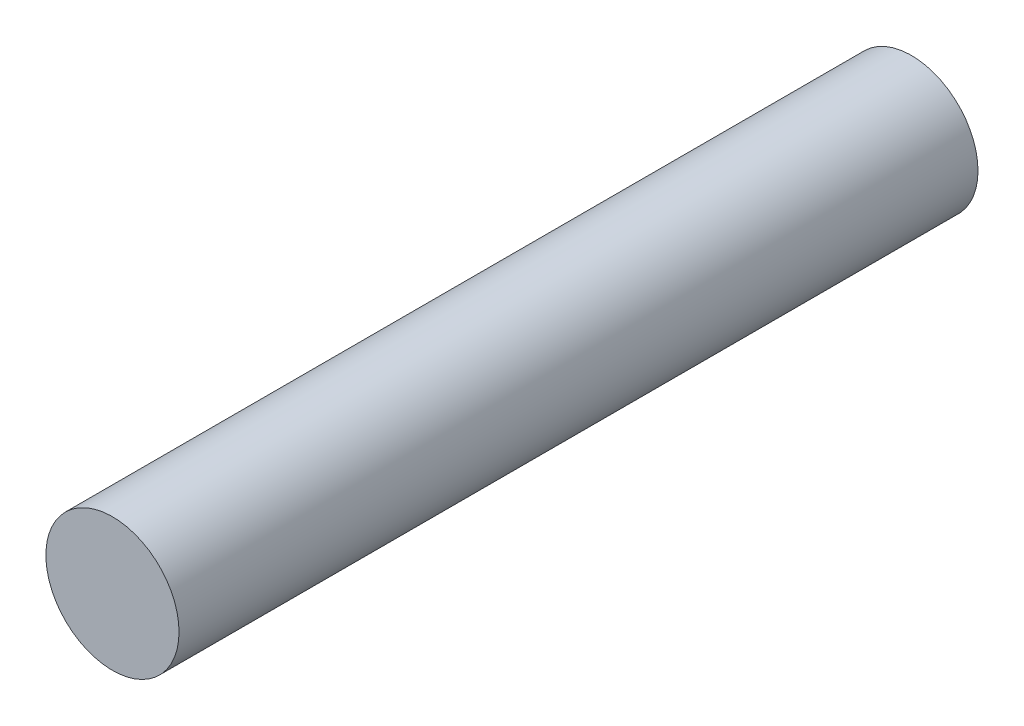
ISO-10303-21;
HEADER;
FILE_DESCRIPTION(('STEP AP214'),'2;1');
FILE_NAME('part.step','',(''),(''),'','','');
FILE_SCHEMA(('AUTOMOTIVE_DESIGN { 1 0 10303 214 1 1 1 1 }'));
ENDSEC;
DATA;
#1=APPLICATION_CONTEXT('core data for automotive mechanical design processes');
#2=APPLICATION_PROTOCOL_DEFINITION('international standard','automotive_design',2000,#1);
#3=PRODUCT_CONTEXT('',#1,'mechanical');
#4=PRODUCT('Part','Part','',(#3));
#5=PRODUCT_RELATED_PRODUCT_CATEGORY('part','',(#4));
#6=PRODUCT_DEFINITION_FORMATION('','',#4);
#7=PRODUCT_DEFINITION_CONTEXT('part definition',#1,'design');
#8=PRODUCT_DEFINITION('design','',#6,#7);
#9=PRODUCT_DEFINITION_SHAPE('','',#8);
#10=(LENGTH_UNIT() NAMED_UNIT(*) SI_UNIT(.MILLI.,.METRE.));
#11=(NAMED_UNIT(*) PLANE_ANGLE_UNIT() SI_UNIT($,.RADIAN.));
#12=(NAMED_UNIT(*) SI_UNIT($,.STERADIAN.) SOLID_ANGLE_UNIT());
#13=UNCERTAINTY_MEASURE_WITH_UNIT(LENGTH_MEASURE(1.E-05),#10,'distance_accuracy_value','');
#14=(GEOMETRIC_REPRESENTATION_CONTEXT(3) GLOBAL_UNCERTAINTY_ASSIGNED_CONTEXT((#13)) GLOBAL_UNIT_ASSIGNED_CONTEXT((#10,
#11,#12)) REPRESENTATION_CONTEXT('',''));
#15=CARTESIAN_POINT('',(0.,0.,0.));
#16=DIRECTION('',(0.,0.,1.));
#17=DIRECTION('',(1.,0.,0.));
#18=AXIS2_PLACEMENT_3D('',#15,#16,#17);
#19=CARTESIAN_POINT('',(-5.9147238073035,4.89993598442764,76.2));
#20=DIRECTION('',(0.,0.,-1.));
#21=DIRECTION('',(-1.,0.,0.));
#22=AXIS2_PLACEMENT_3D('',#19,#20,#21);
#23=CYLINDRICAL_SURFACE('',#22,6.35);
#24=CARTESIAN_POINT('',(-5.9147238073035,4.89993598442764,76.2));
#25=DIRECTION('',(0.,0.,1.));
#26=DIRECTION('',(1.,0.,0.));
#27=AXIS2_PLACEMENT_3D('',#24,#25,#26);
#28=CIRCLE('',#27,6.35);
#29=CARTESIAN_POINT('',(0.435276192696504,4.89993598442764,76.2));
#30=VERTEX_POINT('',#29);
#31=EDGE_CURVE('E10',#30,#30,#28,.T.);
#32=ORIENTED_EDGE('',*,*,#31,.F.);
#33=EDGE_LOOP('',(#32));
#34=FACE_BOUND('',#33,.T.);
#35=CARTESIAN_POINT('',(-5.9147238073035,4.89993598442764,0.));
#36=DIRECTION('',(0.,0.,1.));
#37=DIRECTION('',(1.,0.,0.));
#38=AXIS2_PLACEMENT_3D('',#35,#36,#37);
#39=CIRCLE('',#38,6.35);
#40=CARTESIAN_POINT('',(0.435276192696504,4.89993598442764,0.));
#41=VERTEX_POINT('',#40);
#42=EDGE_CURVE('E39',#41,#41,#39,.T.);
#43=ORIENTED_EDGE('',*,*,#42,.T.);
#44=EDGE_LOOP('',(#43));
#45=FACE_BOUND('',#44,.T.);
#46=ADVANCED_FACE('F36',(#34,#45),#23,.T.);
#47=CARTESIAN_POINT('',(-5.9147238073035,4.89993598442764,76.2));
#48=DIRECTION('',(0.,0.,1.));
#49=DIRECTION('',(1.,0.,0.));
#50=AXIS2_PLACEMENT_3D('',#47,#48,#49);
#51=PLANE('',#50);
#52=ORIENTED_EDGE('',*,*,#31,.T.);
#53=EDGE_LOOP('',(#52));
#54=FACE_BOUND('',#53,.T.);
#55=ADVANCED_FACE('F69',(#54),#51,.T.);
#56=CARTESIAN_POINT('',(-5.9147238073035,4.89993598442764,0.));
#57=DIRECTION('',(0.,0.,1.));
#58=DIRECTION('',(1.,0.,0.));
#59=AXIS2_PLACEMENT_3D('',#56,#57,#58);
#60=PLANE('',#59);
#61=CARTESIAN_POINT('',(-5.9147238073035,4.89993598442764,0.));
#62=DIRECTION('',(0.,0.,-1.));
#63=DIRECTION('',(-1.,0.,0.));
#64=AXIS2_PLACEMENT_3D('',#61,#62,#63);
#65=CIRCLE('',#64,4.7625);
#66=CARTESIAN_POINT('',(-10.6772238073035,4.89993598442764,0.));
#67=VERTEX_POINT('',#66);
#68=EDGE_CURVE('E50',#67,#67,#65,.T.);
#69=ORIENTED_EDGE('',*,*,#68,.F.);
#70=EDGE_LOOP('',(#69));
#71=FACE_BOUND('',#70,.T.);
#72=ORIENTED_EDGE('',*,*,#42,.F.);
#73=EDGE_LOOP('',(#72));
#74=FACE_BOUND('',#73,.T.);
#75=ADVANCED_FACE('F63',(#71,#74),#60,.F.);
#76=CARTESIAN_POINT('',(-5.9147238073035,4.89993598442764,31.75));
#77=DIRECTION('',(0.,0.,-1.));
#78=DIRECTION('',(-1.,0.,0.));
#79=AXIS2_PLACEMENT_3D('',#76,#77,#78);
#80=CYLINDRICAL_SURFACE('',#79,4.7625);
#81=CARTESIAN_POINT('',(-5.9147238073035,4.89993598442764,31.75));
#82=DIRECTION('',(0.,0.,-1.));
#83=DIRECTION('',(-1.,0.,0.));
#84=AXIS2_PLACEMENT_3D('',#81,#82,#83);
#85=CIRCLE('',#84,4.7625);
#86=CARTESIAN_POINT('',(-10.6772238073035,4.89993598442764,31.75));
#87=VERTEX_POINT('',#86);
#88=EDGE_CURVE('E48',#87,#87,#85,.T.);
#89=ORIENTED_EDGE('',*,*,#88,.F.);
#90=EDGE_LOOP('',(#89));
#91=FACE_BOUND('',#90,.T.);
#92=ORIENTED_EDGE('',*,*,#68,.T.);
#93=EDGE_LOOP('',(#92));
#94=FACE_BOUND('',#93,.T.);
#95=ADVANCED_FACE('F60',(#91,#94),#80,.F.);
#96=CARTESIAN_POINT('',(-5.9147238073035,4.89993598442764,31.75));
#97=DIRECTION('',(0.,0.,-1.));
#98=DIRECTION('',(-1.,0.,0.));
#99=AXIS2_PLACEMENT_3D('',#96,#97,#98);
#100=PLANE('',#99);
#101=ORIENTED_EDGE('',*,*,#88,.T.);
#102=EDGE_LOOP('',(#101));
#103=FACE_BOUND('',#102,.T.);
#104=ADVANCED_FACE('F58',(#103),#100,.T.);
#105=CLOSED_SHELL('',(#46,#55,#75,#95,#104));
#106=MANIFOLD_SOLID_BREP('B2',#105);
#107=ADVANCED_BREP_SHAPE_REPRESENTATION('',(#18,#106),#14);
#108=SHAPE_DEFINITION_REPRESENTATION(#9,#107);
ENDSEC;
END-ISO-10303-21;
